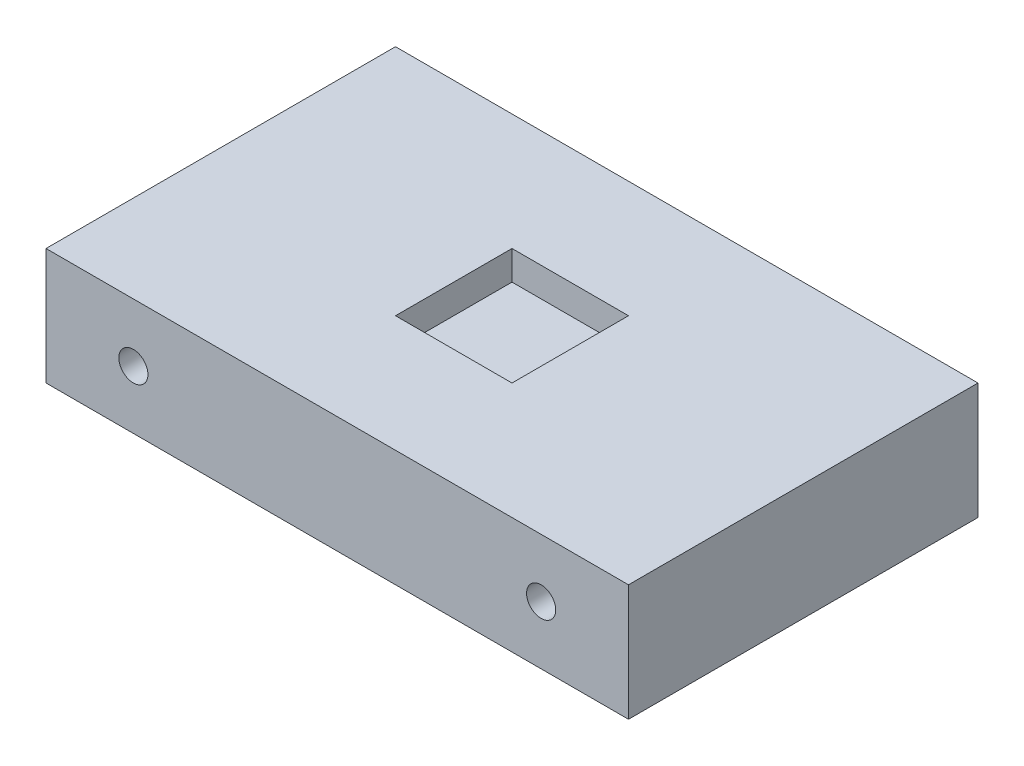
ISO-10303-21;
HEADER;
FILE_DESCRIPTION(('STEP AP214'),'2;1');
FILE_NAME('part.step','',(''),(''),'','','');
FILE_SCHEMA(('AUTOMOTIVE_DESIGN { 1 0 10303 214 1 1 1 1 }'));
ENDSEC;
DATA;
#1=APPLICATION_CONTEXT('core data for automotive mechanical design processes');
#2=APPLICATION_PROTOCOL_DEFINITION('international standard','automotive_design',2000,#1);
#3=PRODUCT_CONTEXT('',#1,'mechanical');
#4=PRODUCT('Part','Part','',(#3));
#5=PRODUCT_RELATED_PRODUCT_CATEGORY('part','',(#4));
#6=PRODUCT_DEFINITION_FORMATION('','',#4);
#7=PRODUCT_DEFINITION_CONTEXT('part definition',#1,'design');
#8=PRODUCT_DEFINITION('design','',#6,#7);
#9=PRODUCT_DEFINITION_SHAPE('','',#8);
#10=(LENGTH_UNIT() NAMED_UNIT(*) SI_UNIT(.MILLI.,.METRE.));
#11=(NAMED_UNIT(*) PLANE_ANGLE_UNIT() SI_UNIT($,.RADIAN.));
#12=(NAMED_UNIT(*) SI_UNIT($,.STERADIAN.) SOLID_ANGLE_UNIT());
#13=UNCERTAINTY_MEASURE_WITH_UNIT(LENGTH_MEASURE(1.E-05),#10,'distance_accuracy_value','');
#14=(GEOMETRIC_REPRESENTATION_CONTEXT(3) GLOBAL_UNCERTAINTY_ASSIGNED_CONTEXT((#13)) GLOBAL_UNIT_ASSIGNED_CONTEXT((#10,
#11,#12)) REPRESENTATION_CONTEXT('',''));
#15=CARTESIAN_POINT('',(0.,0.,0.));
#16=DIRECTION('',(0.,0.,1.));
#17=DIRECTION('',(1.,0.,0.));
#18=AXIS2_PLACEMENT_3D('',#15,#16,#17);
#19=CARTESIAN_POINT('',(0.,0.,76.2));
#20=DIRECTION('',(1.,0.,0.));
#21=DIRECTION('',(0.,0.,-1.));
#22=AXIS2_PLACEMENT_3D('',#19,#20,#21);
#23=PLANE('',#22);
#24=DIRECTION('',(0.,-1.,0.));
#25=VECTOR('',#24,1.);
#26=CARTESIAN_POINT('',(0.,0.,0.));
#27=LINE('',#26,#25);
#28=CARTESIAN_POINT('',(0.,25.4,0.));
#29=VERTEX_POINT('',#28);
#30=CARTESIAN_POINT('',(0.,0.,0.));
#31=VERTEX_POINT('',#30);
#32=EDGE_CURVE('E186',#29,#31,#27,.T.);
#33=ORIENTED_EDGE('',*,*,#32,.T.);
#34=DIRECTION('',(0.,0.,-1.));
#35=VECTOR('',#34,1.);
#36=CARTESIAN_POINT('',(0.,0.,76.2));
#37=LINE('',#36,#35);
#38=CARTESIAN_POINT('',(0.,0.,76.2));
#39=VERTEX_POINT('',#38);
#40=EDGE_CURVE('E11',#39,#31,#37,.T.);
#41=ORIENTED_EDGE('',*,*,#40,.F.);
#42=DIRECTION('',(0.,-1.,0.));
#43=VECTOR('',#42,1.);
#44=CARTESIAN_POINT('',(0.,0.,76.2));
#45=LINE('',#44,#43);
#46=CARTESIAN_POINT('',(0.,25.4,76.2));
#47=VERTEX_POINT('',#46);
#48=EDGE_CURVE('E198',#47,#39,#45,.T.);
#49=ORIENTED_EDGE('',*,*,#48,.F.);
#50=DIRECTION('',(0.,0.,-1.));
#51=VECTOR('',#50,1.);
#52=CARTESIAN_POINT('',(0.,25.4,76.2));
#53=LINE('',#52,#51);
#54=EDGE_CURVE('E208',#47,#29,#53,.T.);
#55=ORIENTED_EDGE('',*,*,#54,.T.);
#56=EDGE_LOOP('',(#33,#41,#49,#55));
#57=FACE_BOUND('',#56,.T.);
#58=ADVANCED_FACE('F41',(#57),#23,.F.);
#59=CARTESIAN_POINT('',(0.,0.,76.2));
#60=DIRECTION('',(0.,1.,0.));
#61=DIRECTION('',(0.,0.,1.));
#62=AXIS2_PLACEMENT_3D('',#59,#60,#61);
#63=PLANE('',#62);
#64=DIRECTION('',(1.,0.,0.));
#65=VECTOR('',#64,1.);
#66=CARTESIAN_POINT('',(0.,0.,0.));
#67=LINE('',#66,#65);
#68=CARTESIAN_POINT('',(127.,0.,0.));
#69=VERTEX_POINT('',#68);
#70=EDGE_CURVE('E212',#31,#69,#67,.T.);
#71=ORIENTED_EDGE('',*,*,#70,.T.);
#72=DIRECTION('',(0.,0.,-1.));
#73=VECTOR('',#72,1.);
#74=CARTESIAN_POINT('',(127.,0.,76.2));
#75=LINE('',#74,#73);
#76=CARTESIAN_POINT('',(127.,0.,76.2));
#77=VERTEX_POINT('',#76);
#78=EDGE_CURVE('E49',#77,#69,#75,.T.);
#79=ORIENTED_EDGE('',*,*,#78,.F.);
#80=DIRECTION('',(1.,0.,0.));
#81=VECTOR('',#80,1.);
#82=CARTESIAN_POINT('',(0.,0.,76.2));
#83=LINE('',#82,#81);
#84=EDGE_CURVE('E93',#39,#77,#83,.T.);
#85=ORIENTED_EDGE('',*,*,#84,.F.);
#86=ORIENTED_EDGE('',*,*,#40,.T.);
#87=EDGE_LOOP('',(#71,#79,#85,#86));
#88=FACE_BOUND('',#87,.T.);
#89=ADVANCED_FACE('F248',(#88),#63,.F.);
#90=CARTESIAN_POINT('',(127.,0.,76.2));
#91=DIRECTION('',(-1.,0.,0.));
#92=DIRECTION('',(0.,0.,1.));
#93=AXIS2_PLACEMENT_3D('',#90,#91,#92);
#94=PLANE('',#93);
#95=DIRECTION('',(0.,1.,0.));
#96=VECTOR('',#95,1.);
#97=CARTESIAN_POINT('',(127.,0.,0.));
#98=LINE('',#97,#96);
#99=CARTESIAN_POINT('',(127.,25.4,0.));
#100=VERTEX_POINT('',#99);
#101=EDGE_CURVE('E215',#69,#100,#98,.T.);
#102=ORIENTED_EDGE('',*,*,#101,.T.);
#103=DIRECTION('',(0.,0.,-1.));
#104=VECTOR('',#103,1.);
#105=CARTESIAN_POINT('',(127.,25.4,76.2));
#106=LINE('',#105,#104);
#107=CARTESIAN_POINT('',(127.,25.4,76.2));
#108=VERTEX_POINT('',#107);
#109=EDGE_CURVE('E222',#108,#100,#106,.T.);
#110=ORIENTED_EDGE('',*,*,#109,.F.);
#111=DIRECTION('',(0.,1.,0.));
#112=VECTOR('',#111,1.);
#113=CARTESIAN_POINT('',(127.,0.,76.2));
#114=LINE('',#113,#112);
#115=EDGE_CURVE('E203',#77,#108,#114,.T.);
#116=ORIENTED_EDGE('',*,*,#115,.F.);
#117=ORIENTED_EDGE('',*,*,#78,.T.);
#118=EDGE_LOOP('',(#102,#110,#116,#117));
#119=FACE_BOUND('',#118,.T.);
#120=ADVANCED_FACE('F229',(#119),#94,.F.);
#121=CARTESIAN_POINT('',(0.,25.4,76.2));
#122=DIRECTION('',(0.,-1.,0.));
#123=DIRECTION('',(0.,0.,-1.));
#124=AXIS2_PLACEMENT_3D('',#121,#122,#123);
#125=PLANE('',#124);
#126=DIRECTION('',(1.,0.,0.));
#127=VECTOR('',#126,1.);
#128=CARTESIAN_POINT('',(50.8,25.4,50.8));
#129=LINE('',#128,#127);
#130=CARTESIAN_POINT('',(50.8,25.4,50.8));
#131=VERTEX_POINT('',#130);
#132=CARTESIAN_POINT('',(76.2,25.4,50.8));
#133=VERTEX_POINT('',#132);
#134=EDGE_CURVE('E151',#131,#133,#129,.T.);
#135=ORIENTED_EDGE('',*,*,#134,.F.);
#136=DIRECTION('',(0.,0.,1.));
#137=VECTOR('',#136,1.);
#138=CARTESIAN_POINT('',(50.8,25.4,25.4));
#139=LINE('',#138,#137);
#140=CARTESIAN_POINT('',(50.8,25.4,25.4));
#141=VERTEX_POINT('',#140);
#142=EDGE_CURVE('E56',#141,#131,#139,.T.);
#143=ORIENTED_EDGE('',*,*,#142,.F.);
#144=DIRECTION('',(-1.,0.,0.));
#145=VECTOR('',#144,1.);
#146=CARTESIAN_POINT('',(50.8,25.4,25.4));
#147=LINE('',#146,#145);
#148=CARTESIAN_POINT('',(76.2,25.4,25.4));
#149=VERTEX_POINT('',#148);
#150=EDGE_CURVE('E138',#149,#141,#147,.T.);
#151=ORIENTED_EDGE('',*,*,#150,.F.);
#152=DIRECTION('',(0.,0.,-1.));
#153=VECTOR('',#152,1.);
#154=CARTESIAN_POINT('',(76.2,25.4,25.4));
#155=LINE('',#154,#153);
#156=EDGE_CURVE('E142',#133,#149,#155,.T.);
#157=ORIENTED_EDGE('',*,*,#156,.F.);
#158=EDGE_LOOP('',(#135,#143,#151,#157));
#159=FACE_BOUND('',#158,.T.);
#160=DIRECTION('',(-1.,0.,0.));
#161=VECTOR('',#160,1.);
#162=CARTESIAN_POINT('',(0.,25.4,0.));
#163=LINE('',#162,#161);
#164=EDGE_CURVE('E86',#100,#29,#163,.T.);
#165=ORIENTED_EDGE('',*,*,#164,.T.);
#166=ORIENTED_EDGE('',*,*,#54,.F.);
#167=DIRECTION('',(-1.,0.,0.));
#168=VECTOR('',#167,1.);
#169=CARTESIAN_POINT('',(0.,25.4,76.2));
#170=LINE('',#169,#168);
#171=EDGE_CURVE('E65',#108,#47,#170,.T.);
#172=ORIENTED_EDGE('',*,*,#171,.F.);
#173=ORIENTED_EDGE('',*,*,#109,.T.);
#174=EDGE_LOOP('',(#165,#166,#172,#173));
#175=FACE_BOUND('',#174,.T.);
#176=ADVANCED_FACE('F237',(#159,#175),#125,.F.);
#177=CARTESIAN_POINT('',(0.,0.,76.2));
#178=DIRECTION('',(0.,0.,-1.));
#179=DIRECTION('',(-1.,0.,0.));
#180=AXIS2_PLACEMENT_3D('',#177,#178,#179);
#181=PLANE('',#180);
#182=CARTESIAN_POINT('',(19.05,12.7,76.2));
#183=DIRECTION('',(0.,0.,1.));
#184=DIRECTION('',(1.,0.,0.));
#185=AXIS2_PLACEMENT_3D('',#182,#183,#184);
#186=CIRCLE('',#185,3.175);
#187=CARTESIAN_POINT('',(22.225,12.7,76.2));
#188=VERTEX_POINT('',#187);
#189=EDGE_CURVE('E187',#188,#188,#186,.T.);
#190=ORIENTED_EDGE('',*,*,#189,.F.);
#191=EDGE_LOOP('',(#190));
#192=FACE_BOUND('',#191,.T.);
#193=CARTESIAN_POINT('',(107.95,12.7,76.2));
#194=DIRECTION('',(0.,0.,1.));
#195=DIRECTION('',(1.,0.,0.));
#196=AXIS2_PLACEMENT_3D('',#193,#194,#195);
#197=CIRCLE('',#196,3.175);
#198=CARTESIAN_POINT('',(111.125,12.7,76.2));
#199=VERTEX_POINT('',#198);
#200=EDGE_CURVE('E170',#199,#199,#197,.T.);
#201=ORIENTED_EDGE('',*,*,#200,.F.);
#202=EDGE_LOOP('',(#201));
#203=FACE_BOUND('',#202,.T.);
#204=ORIENTED_EDGE('',*,*,#48,.T.);
#205=ORIENTED_EDGE('',*,*,#84,.T.);
#206=ORIENTED_EDGE('',*,*,#115,.T.);
#207=ORIENTED_EDGE('',*,*,#171,.T.);
#208=EDGE_LOOP('',(#204,#205,#206,#207));
#209=FACE_BOUND('',#208,.T.);
#210=ADVANCED_FACE('F239',(#192,#203,#209),#181,.F.);
#211=CARTESIAN_POINT('',(0.,0.,0.));
#212=DIRECTION('',(0.,0.,-1.));
#213=DIRECTION('',(-1.,0.,0.));
#214=AXIS2_PLACEMENT_3D('',#211,#212,#213);
#215=PLANE('',#214);
#216=CARTESIAN_POINT('',(107.95,12.7,0.));
#217=DIRECTION('',(0.,0.,-1.));
#218=DIRECTION('',(-1.,0.,0.));
#219=AXIS2_PLACEMENT_3D('',#216,#217,#218);
#220=CIRCLE('',#219,3.175);
#221=CARTESIAN_POINT('',(104.775,12.7,0.));
#222=VERTEX_POINT('',#221);
#223=EDGE_CURVE('E171',#222,#222,#220,.T.);
#224=ORIENTED_EDGE('',*,*,#223,.F.);
#225=EDGE_LOOP('',(#224));
#226=FACE_BOUND('',#225,.T.);
#227=CARTESIAN_POINT('',(19.05,12.7,0.));
#228=DIRECTION('',(0.,0.,-1.));
#229=DIRECTION('',(-1.,0.,0.));
#230=AXIS2_PLACEMENT_3D('',#227,#228,#229);
#231=CIRCLE('',#230,3.175);
#232=CARTESIAN_POINT('',(15.875,12.7,0.));
#233=VERTEX_POINT('',#232);
#234=EDGE_CURVE('E160',#233,#233,#231,.T.);
#235=ORIENTED_EDGE('',*,*,#234,.F.);
#236=EDGE_LOOP('',(#235));
#237=FACE_BOUND('',#236,.T.);
#238=ORIENTED_EDGE('',*,*,#32,.F.);
#239=ORIENTED_EDGE('',*,*,#164,.F.);
#240=ORIENTED_EDGE('',*,*,#101,.F.);
#241=ORIENTED_EDGE('',*,*,#70,.F.);
#242=EDGE_LOOP('',(#238,#239,#240,#241));
#243=FACE_BOUND('',#242,.T.);
#244=ADVANCED_FACE('F233',(#226,#237,#243),#215,.T.);
#245=CARTESIAN_POINT('',(107.95,12.7,63.5));
#246=DIRECTION('',(0.,0.,1.));
#247=DIRECTION('',(1.,0.,0.));
#248=AXIS2_PLACEMENT_3D('',#245,#246,#247);
#249=CYLINDRICAL_SURFACE('',#248,3.175);
#250=CARTESIAN_POINT('',(107.95,12.7,63.5));
#251=DIRECTION('',(0.,0.,1.));
#252=DIRECTION('',(1.,0.,0.));
#253=AXIS2_PLACEMENT_3D('',#250,#251,#252);
#254=CIRCLE('',#253,3.175);
#255=CARTESIAN_POINT('',(111.125,12.7,63.5));
#256=VERTEX_POINT('',#255);
#257=EDGE_CURVE('E191',#256,#256,#254,.T.);
#258=ORIENTED_EDGE('',*,*,#257,.F.);
#259=EDGE_LOOP('',(#258));
#260=FACE_BOUND('',#259,.T.);
#261=ORIENTED_EDGE('',*,*,#200,.T.);
#262=EDGE_LOOP('',(#261));
#263=FACE_BOUND('',#262,.T.);
#264=ADVANCED_FACE('F275',(#260,#263),#249,.F.);
#265=CARTESIAN_POINT('',(107.95,12.7,63.5));
#266=DIRECTION('',(0.,0.,1.));
#267=DIRECTION('',(1.,0.,0.));
#268=AXIS2_PLACEMENT_3D('',#265,#266,#267);
#269=PLANE('',#268);
#270=ORIENTED_EDGE('',*,*,#257,.T.);
#271=EDGE_LOOP('',(#270));
#272=FACE_BOUND('',#271,.T.);
#273=ADVANCED_FACE('F280',(#272),#269,.T.);
#274=CARTESIAN_POINT('',(19.05,12.7,63.5));
#275=DIRECTION('',(0.,0.,1.));
#276=DIRECTION('',(1.,0.,0.));
#277=AXIS2_PLACEMENT_3D('',#274,#275,#276);
#278=CYLINDRICAL_SURFACE('',#277,3.175);
#279=CARTESIAN_POINT('',(19.05,12.7,63.5));
#280=DIRECTION('',(0.,0.,1.));
#281=DIRECTION('',(1.,0.,0.));
#282=AXIS2_PLACEMENT_3D('',#279,#280,#281);
#283=CIRCLE('',#282,3.175);
#284=CARTESIAN_POINT('',(22.225,12.7,63.5));
#285=VERTEX_POINT('',#284);
#286=EDGE_CURVE('E182',#285,#285,#283,.T.);
#287=ORIENTED_EDGE('',*,*,#286,.F.);
#288=EDGE_LOOP('',(#287));
#289=FACE_BOUND('',#288,.T.);
#290=ORIENTED_EDGE('',*,*,#189,.T.);
#291=EDGE_LOOP('',(#290));
#292=FACE_BOUND('',#291,.T.);
#293=ADVANCED_FACE('F290',(#289,#292),#278,.F.);
#294=CARTESIAN_POINT('',(19.05,12.7,63.5));
#295=DIRECTION('',(0.,0.,1.));
#296=DIRECTION('',(1.,0.,0.));
#297=AXIS2_PLACEMENT_3D('',#294,#295,#296);
#298=PLANE('',#297);
#299=ORIENTED_EDGE('',*,*,#286,.T.);
#300=EDGE_LOOP('',(#299));
#301=FACE_BOUND('',#300,.T.);
#302=ADVANCED_FACE('F300',(#301),#298,.T.);
#303=CARTESIAN_POINT('',(19.05,12.7,12.7));
#304=DIRECTION('',(0.,0.,-1.));
#305=DIRECTION('',(-1.,0.,0.));
#306=AXIS2_PLACEMENT_3D('',#303,#304,#305);
#307=CYLINDRICAL_SURFACE('',#306,3.175);
#308=CARTESIAN_POINT('',(19.05,12.7,12.7));
#309=DIRECTION('',(0.,0.,-1.));
#310=DIRECTION('',(-1.,0.,0.));
#311=AXIS2_PLACEMENT_3D('',#308,#309,#310);
#312=CIRCLE('',#311,3.175);
#313=CARTESIAN_POINT('',(15.875,12.7,12.7));
#314=VERTEX_POINT('',#313);
#315=EDGE_CURVE('E175',#314,#314,#312,.T.);
#316=ORIENTED_EDGE('',*,*,#315,.F.);
#317=EDGE_LOOP('',(#316));
#318=FACE_BOUND('',#317,.T.);
#319=ORIENTED_EDGE('',*,*,#234,.T.);
#320=EDGE_LOOP('',(#319));
#321=FACE_BOUND('',#320,.T.);
#322=ADVANCED_FACE('F310',(#318,#321),#307,.F.);
#323=CARTESIAN_POINT('',(19.05,12.7,12.7));
#324=DIRECTION('',(0.,0.,-1.));
#325=DIRECTION('',(-1.,0.,0.));
#326=AXIS2_PLACEMENT_3D('',#323,#324,#325);
#327=PLANE('',#326);
#328=ORIENTED_EDGE('',*,*,#315,.T.);
#329=EDGE_LOOP('',(#328));
#330=FACE_BOUND('',#329,.T.);
#331=ADVANCED_FACE('F326',(#330),#327,.T.);
#332=CARTESIAN_POINT('',(107.95,12.7,12.7));
#333=DIRECTION('',(0.,0.,-1.));
#334=DIRECTION('',(-1.,0.,0.));
#335=AXIS2_PLACEMENT_3D('',#332,#333,#334);
#336=CYLINDRICAL_SURFACE('',#335,3.175);
#337=CARTESIAN_POINT('',(107.95,12.7,12.7));
#338=DIRECTION('',(0.,0.,-1.));
#339=DIRECTION('',(-1.,0.,0.));
#340=AXIS2_PLACEMENT_3D('',#337,#338,#339);
#341=CIRCLE('',#340,3.175);
#342=CARTESIAN_POINT('',(104.775,12.7,12.7));
#343=VERTEX_POINT('',#342);
#344=EDGE_CURVE('E166',#343,#343,#341,.T.);
#345=ORIENTED_EDGE('',*,*,#344,.F.);
#346=EDGE_LOOP('',(#345));
#347=FACE_BOUND('',#346,.T.);
#348=ORIENTED_EDGE('',*,*,#223,.T.);
#349=EDGE_LOOP('',(#348));
#350=FACE_BOUND('',#349,.T.);
#351=ADVANCED_FACE('F336',(#347,#350),#336,.F.);
#352=CARTESIAN_POINT('',(107.95,12.7,12.7));
#353=DIRECTION('',(0.,0.,-1.));
#354=DIRECTION('',(-1.,0.,0.));
#355=AXIS2_PLACEMENT_3D('',#352,#353,#354);
#356=PLANE('',#355);
#357=ORIENTED_EDGE('',*,*,#344,.T.);
#358=EDGE_LOOP('',(#357));
#359=FACE_BOUND('',#358,.T.);
#360=ADVANCED_FACE('F346',(#359),#356,.T.);
#361=CARTESIAN_POINT('',(50.8,19.05,25.4));
#362=DIRECTION('',(-1.,0.,0.));
#363=DIRECTION('',(0.,0.,1.));
#364=AXIS2_PLACEMENT_3D('',#361,#362,#363);
#365=PLANE('',#364);
#366=ORIENTED_EDGE('',*,*,#142,.T.);
#367=DIRECTION('',(0.,1.,0.));
#368=VECTOR('',#367,1.);
#369=CARTESIAN_POINT('',(50.8,19.05,50.8));
#370=LINE('',#369,#368);
#371=CARTESIAN_POINT('',(50.8,19.05,50.8));
#372=VERTEX_POINT('',#371);
#373=EDGE_CURVE('E113',#372,#131,#370,.T.);
#374=ORIENTED_EDGE('',*,*,#373,.F.);
#375=DIRECTION('',(0.,0.,1.));
#376=VECTOR('',#375,1.);
#377=CARTESIAN_POINT('',(50.8,19.05,25.4));
#378=LINE('',#377,#376);
#379=CARTESIAN_POINT('',(50.8,19.05,25.4));
#380=VERTEX_POINT('',#379);
#381=EDGE_CURVE('E117',#380,#372,#378,.T.);
#382=ORIENTED_EDGE('',*,*,#381,.F.);
#383=DIRECTION('',(0.,1.,0.));
#384=VECTOR('',#383,1.);
#385=CARTESIAN_POINT('',(50.8,19.05,25.4));
#386=LINE('',#385,#384);
#387=EDGE_CURVE('E157',#380,#141,#386,.T.);
#388=ORIENTED_EDGE('',*,*,#387,.T.);
#389=EDGE_LOOP('',(#366,#374,#382,#388));
#390=FACE_BOUND('',#389,.T.);
#391=ADVANCED_FACE('F115',(#390),#365,.F.);
#392=CARTESIAN_POINT('',(50.8,19.05,25.4));
#393=DIRECTION('',(0.,0.,-1.));
#394=DIRECTION('',(-1.,0.,0.));
#395=AXIS2_PLACEMENT_3D('',#392,#393,#394);
#396=PLANE('',#395);
#397=ORIENTED_EDGE('',*,*,#150,.T.);
#398=ORIENTED_EDGE('',*,*,#387,.F.);
#399=DIRECTION('',(-1.,0.,0.));
#400=VECTOR('',#399,1.);
#401=CARTESIAN_POINT('',(50.8,19.05,25.4));
#402=LINE('',#401,#400);
#403=CARTESIAN_POINT('',(76.2,19.05,25.4));
#404=VERTEX_POINT('',#403);
#405=EDGE_CURVE('E124',#404,#380,#402,.T.);
#406=ORIENTED_EDGE('',*,*,#405,.F.);
#407=DIRECTION('',(0.,1.,0.));
#408=VECTOR('',#407,1.);
#409=CARTESIAN_POINT('',(76.2,19.05,25.4));
#410=LINE('',#409,#408);
#411=EDGE_CURVE('E161',#404,#149,#410,.T.);
#412=ORIENTED_EDGE('',*,*,#411,.T.);
#413=EDGE_LOOP('',(#397,#398,#406,#412));
#414=FACE_BOUND('',#413,.T.);
#415=ADVANCED_FACE('F368',(#414),#396,.F.);
#416=CARTESIAN_POINT('',(76.2,19.05,25.4));
#417=DIRECTION('',(1.,0.,0.));
#418=DIRECTION('',(0.,0.,-1.));
#419=AXIS2_PLACEMENT_3D('',#416,#417,#418);
#420=PLANE('',#419);
#421=ORIENTED_EDGE('',*,*,#156,.T.);
#422=ORIENTED_EDGE('',*,*,#411,.F.);
#423=DIRECTION('',(0.,0.,-1.));
#424=VECTOR('',#423,1.);
#425=CARTESIAN_POINT('',(76.2,19.05,25.4));
#426=LINE('',#425,#424);
#427=CARTESIAN_POINT('',(76.2,19.05,50.8));
#428=VERTEX_POINT('',#427);
#429=EDGE_CURVE('E133',#428,#404,#426,.T.);
#430=ORIENTED_EDGE('',*,*,#429,.F.);
#431=DIRECTION('',(0.,1.,0.));
#432=VECTOR('',#431,1.);
#433=CARTESIAN_POINT('',(76.2,19.05,50.8));
#434=LINE('',#433,#432);
#435=EDGE_CURVE('E123',#428,#133,#434,.T.);
#436=ORIENTED_EDGE('',*,*,#435,.T.);
#437=EDGE_LOOP('',(#421,#422,#430,#436));
#438=FACE_BOUND('',#437,.T.);
#439=ADVANCED_FACE('F377',(#438),#420,.F.);
#440=CARTESIAN_POINT('',(50.8,19.05,50.8));
#441=DIRECTION('',(0.,0.,1.));
#442=DIRECTION('',(1.,0.,0.));
#443=AXIS2_PLACEMENT_3D('',#440,#441,#442);
#444=PLANE('',#443);
#445=ORIENTED_EDGE('',*,*,#134,.T.);
#446=ORIENTED_EDGE('',*,*,#435,.F.);
#447=DIRECTION('',(1.,0.,0.));
#448=VECTOR('',#447,1.);
#449=CARTESIAN_POINT('',(50.8,19.05,50.8));
#450=LINE('',#449,#448);
#451=EDGE_CURVE('E127',#372,#428,#450,.T.);
#452=ORIENTED_EDGE('',*,*,#451,.F.);
#453=ORIENTED_EDGE('',*,*,#373,.T.);
#454=EDGE_LOOP('',(#445,#446,#452,#453));
#455=FACE_BOUND('',#454,.T.);
#456=ADVANCED_FACE('F128',(#455),#444,.F.);
#457=CARTESIAN_POINT('',(0.,19.05,0.));
#458=DIRECTION('',(0.,1.,0.));
#459=DIRECTION('',(0.,0.,1.));
#460=AXIS2_PLACEMENT_3D('',#457,#458,#459);
#461=PLANE('',#460);
#462=ORIENTED_EDGE('',*,*,#381,.T.);
#463=ORIENTED_EDGE('',*,*,#451,.T.);
#464=ORIENTED_EDGE('',*,*,#429,.T.);
#465=ORIENTED_EDGE('',*,*,#405,.T.);
#466=EDGE_LOOP('',(#462,#463,#464,#465));
#467=FACE_BOUND('',#466,.T.);
#468=ADVANCED_FACE('F135',(#467),#461,.T.);
#469=CLOSED_SHELL('',(#58,#89,#120,#176,#210,#244,#264,#273,#293,#302,#322,#331,#351,#360,#391,
#415,#439,#456,#468));
#470=MANIFOLD_SOLID_BREP('B2',#469);
#471=ADVANCED_BREP_SHAPE_REPRESENTATION('',(#18,#470),#14);
#472=SHAPE_DEFINITION_REPRESENTATION(#9,#471);
ENDSEC;
END-ISO-10303-21;
